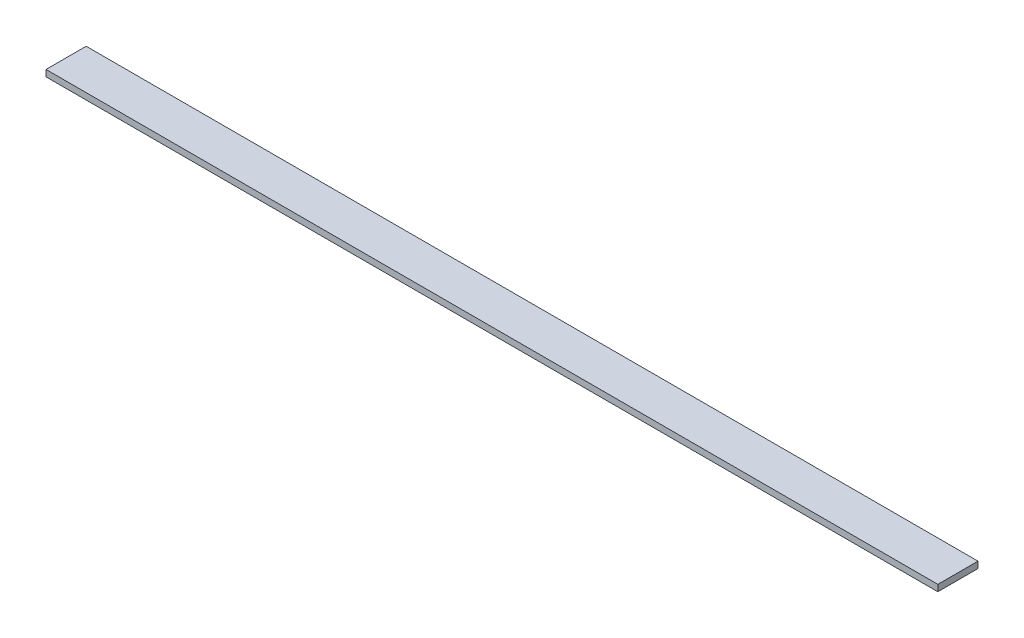
ISO-10303-21;
HEADER;
FILE_DESCRIPTION(('STEP AP214'),'2;1');
FILE_NAME('part.step','',(''),(''),'','','');
FILE_SCHEMA(('AUTOMOTIVE_DESIGN { 1 0 10303 214 1 1 1 1 }'));
ENDSEC;
DATA;
#1=APPLICATION_CONTEXT('core data for automotive mechanical design processes');
#2=APPLICATION_PROTOCOL_DEFINITION('international standard','automotive_design',2000,#1);
#3=PRODUCT_CONTEXT('',#1,'mechanical');
#4=PRODUCT('Part','Part','',(#3));
#5=PRODUCT_RELATED_PRODUCT_CATEGORY('part','',(#4));
#6=PRODUCT_DEFINITION_FORMATION('','',#4);
#7=PRODUCT_DEFINITION_CONTEXT('part definition',#1,'design');
#8=PRODUCT_DEFINITION('design','',#6,#7);
#9=PRODUCT_DEFINITION_SHAPE('','',#8);
#10=(LENGTH_UNIT() NAMED_UNIT(*) SI_UNIT(.MILLI.,.METRE.));
#11=(NAMED_UNIT(*) PLANE_ANGLE_UNIT() SI_UNIT($,.RADIAN.));
#12=(NAMED_UNIT(*) SI_UNIT($,.STERADIAN.) SOLID_ANGLE_UNIT());
#13=UNCERTAINTY_MEASURE_WITH_UNIT(LENGTH_MEASURE(1.E-05),#10,'distance_accuracy_value','');
#14=(GEOMETRIC_REPRESENTATION_CONTEXT(3) GLOBAL_UNCERTAINTY_ASSIGNED_CONTEXT((#13)) GLOBAL_UNIT_ASSIGNED_CONTEXT((#10,
#11,#12)) REPRESENTATION_CONTEXT('',''));
#15=CARTESIAN_POINT('',(0.,0.,0.));
#16=DIRECTION('',(0.,0.,1.));
#17=DIRECTION('',(1.,0.,0.));
#18=AXIS2_PLACEMENT_3D('',#15,#16,#17);
#19=CARTESIAN_POINT('',(277.5,4.,12.5));
#20=DIRECTION('',(-1.,0.,0.));
#21=DIRECTION('',(0.,0.,1.));
#22=AXIS2_PLACEMENT_3D('',#19,#20,#21);
#23=PLANE('',#22);
#24=DIRECTION('',(0.,0.,-1.));
#25=VECTOR('',#24,1.);
#26=CARTESIAN_POINT('',(277.5,0.,12.5));
#27=LINE('',#26,#25);
#28=CARTESIAN_POINT('',(277.5,0.,12.5));
#29=VERTEX_POINT('',#28);
#30=CARTESIAN_POINT('',(277.5,0.,-12.5));
#31=VERTEX_POINT('',#30);
#32=EDGE_CURVE('E98',#29,#31,#27,.T.);
#33=ORIENTED_EDGE('',*,*,#32,.T.);
#34=DIRECTION('',(0.,-1.,0.));
#35=VECTOR('',#34,1.);
#36=CARTESIAN_POINT('',(277.5,4.,-12.5));
#37=LINE('',#36,#35);
#38=CARTESIAN_POINT('',(277.5,4.,-12.5));
#39=VERTEX_POINT('',#38);
#40=EDGE_CURVE('E11',#39,#31,#37,.T.);
#41=ORIENTED_EDGE('',*,*,#40,.F.);
#42=DIRECTION('',(0.,0.,-1.));
#43=VECTOR('',#42,1.);
#44=CARTESIAN_POINT('',(277.5,4.,12.5));
#45=LINE('',#44,#43);
#46=CARTESIAN_POINT('',(277.5,4.,12.5));
#47=VERTEX_POINT('',#46);
#48=EDGE_CURVE('E86',#47,#39,#45,.T.);
#49=ORIENTED_EDGE('',*,*,#48,.F.);
#50=DIRECTION('',(0.,-1.,0.));
#51=VECTOR('',#50,1.);
#52=CARTESIAN_POINT('',(277.5,4.,12.5));
#53=LINE('',#52,#51);
#54=EDGE_CURVE('E94',#47,#29,#53,.T.);
#55=ORIENTED_EDGE('',*,*,#54,.T.);
#56=EDGE_LOOP('',(#33,#41,#49,#55));
#57=FACE_BOUND('',#56,.T.);
#58=ADVANCED_FACE('F35',(#57),#23,.F.);
#59=CARTESIAN_POINT('',(-277.5,4.,-12.5));
#60=DIRECTION('',(0.,0.,1.));
#61=DIRECTION('',(1.,0.,0.));
#62=AXIS2_PLACEMENT_3D('',#59,#60,#61);
#63=PLANE('',#62);
#64=DIRECTION('',(-1.,0.,0.));
#65=VECTOR('',#64,1.);
#66=CARTESIAN_POINT('',(-277.5,0.,-12.5));
#67=LINE('',#66,#65);
#68=CARTESIAN_POINT('',(-277.5,0.,-12.5));
#69=VERTEX_POINT('',#68);
#70=EDGE_CURVE('E90',#31,#69,#67,.T.);
#71=ORIENTED_EDGE('',*,*,#70,.T.);
#72=DIRECTION('',(0.,-1.,0.));
#73=VECTOR('',#72,1.);
#74=CARTESIAN_POINT('',(-277.5,4.,-12.5));
#75=LINE('',#74,#73);
#76=CARTESIAN_POINT('',(-277.5,4.,-12.5));
#77=VERTEX_POINT('',#76);
#78=EDGE_CURVE('E43',#77,#69,#75,.T.);
#79=ORIENTED_EDGE('',*,*,#78,.F.);
#80=DIRECTION('',(-1.,0.,0.));
#81=VECTOR('',#80,1.);
#82=CARTESIAN_POINT('',(-277.5,4.,-12.5));
#83=LINE('',#82,#81);
#84=EDGE_CURVE('E81',#39,#77,#83,.T.);
#85=ORIENTED_EDGE('',*,*,#84,.F.);
#86=ORIENTED_EDGE('',*,*,#40,.T.);
#87=EDGE_LOOP('',(#71,#79,#85,#86));
#88=FACE_BOUND('',#87,.T.);
#89=ADVANCED_FACE('F89',(#88),#63,.F.);
#90=CARTESIAN_POINT('',(-277.5,4.,12.5));
#91=DIRECTION('',(1.,0.,0.));
#92=DIRECTION('',(0.,0.,-1.));
#93=AXIS2_PLACEMENT_3D('',#90,#91,#92);
#94=PLANE('',#93);
#95=DIRECTION('',(0.,0.,1.));
#96=VECTOR('',#95,1.);
#97=CARTESIAN_POINT('',(-277.5,0.,12.5));
#98=LINE('',#97,#96);
#99=CARTESIAN_POINT('',(-277.5,0.,12.5));
#100=VERTEX_POINT('',#99);
#101=EDGE_CURVE('E68',#69,#100,#98,.T.);
#102=ORIENTED_EDGE('',*,*,#101,.T.);
#103=DIRECTION('',(0.,-1.,0.));
#104=VECTOR('',#103,1.);
#105=CARTESIAN_POINT('',(-277.5,4.,12.5));
#106=LINE('',#105,#104);
#107=CARTESIAN_POINT('',(-277.5,4.,12.5));
#108=VERTEX_POINT('',#107);
#109=EDGE_CURVE('E91',#108,#100,#106,.T.);
#110=ORIENTED_EDGE('',*,*,#109,.F.);
#111=DIRECTION('',(0.,0.,1.));
#112=VECTOR('',#111,1.);
#113=CARTESIAN_POINT('',(-277.5,4.,12.5));
#114=LINE('',#113,#112);
#115=EDGE_CURVE('E84',#77,#108,#114,.T.);
#116=ORIENTED_EDGE('',*,*,#115,.F.);
#117=ORIENTED_EDGE('',*,*,#78,.T.);
#118=EDGE_LOOP('',(#102,#110,#116,#117));
#119=FACE_BOUND('',#118,.T.);
#120=ADVANCED_FACE('F92',(#119),#94,.F.);
#121=CARTESIAN_POINT('',(-277.5,4.,12.5));
#122=DIRECTION('',(0.,0.,-1.));
#123=DIRECTION('',(-1.,0.,0.));
#124=AXIS2_PLACEMENT_3D('',#121,#122,#123);
#125=PLANE('',#124);
#126=DIRECTION('',(1.,0.,0.));
#127=VECTOR('',#126,1.);
#128=CARTESIAN_POINT('',(-277.5,0.,12.5));
#129=LINE('',#128,#127);
#130=EDGE_CURVE('E74',#100,#29,#129,.T.);
#131=ORIENTED_EDGE('',*,*,#130,.T.);
#132=ORIENTED_EDGE('',*,*,#54,.F.);
#133=DIRECTION('',(1.,0.,0.));
#134=VECTOR('',#133,1.);
#135=CARTESIAN_POINT('',(-277.5,4.,12.5));
#136=LINE('',#135,#134);
#137=EDGE_CURVE('E51',#108,#47,#136,.T.);
#138=ORIENTED_EDGE('',*,*,#137,.F.);
#139=ORIENTED_EDGE('',*,*,#109,.T.);
#140=EDGE_LOOP('',(#131,#132,#138,#139));
#141=FACE_BOUND('',#140,.T.);
#142=ADVANCED_FACE('F105',(#141),#125,.F.);
#143=CARTESIAN_POINT('',(0.,4.,0.));
#144=DIRECTION('',(0.,-1.,0.));
#145=DIRECTION('',(0.,0.,-1.));
#146=AXIS2_PLACEMENT_3D('',#143,#144,#145);
#147=PLANE('',#146);
#148=ORIENTED_EDGE('',*,*,#48,.T.);
#149=ORIENTED_EDGE('',*,*,#84,.T.);
#150=ORIENTED_EDGE('',*,*,#115,.T.);
#151=ORIENTED_EDGE('',*,*,#137,.T.);
#152=EDGE_LOOP('',(#148,#149,#150,#151));
#153=FACE_BOUND('',#152,.T.);
#154=ADVANCED_FACE('F82',(#153),#147,.F.);
#155=CARTESIAN_POINT('',(0.,0.,0.));
#156=DIRECTION('',(0.,-1.,0.));
#157=DIRECTION('',(0.,0.,-1.));
#158=AXIS2_PLACEMENT_3D('',#155,#156,#157);
#159=PLANE('',#158);
#160=ORIENTED_EDGE('',*,*,#32,.F.);
#161=ORIENTED_EDGE('',*,*,#130,.F.);
#162=ORIENTED_EDGE('',*,*,#101,.F.);
#163=ORIENTED_EDGE('',*,*,#70,.F.);
#164=EDGE_LOOP('',(#160,#161,#162,#163));
#165=FACE_BOUND('',#164,.T.);
#166=ADVANCED_FACE('F108',(#165),#159,.T.);
#167=CLOSED_SHELL('',(#58,#89,#120,#142,#154,#166));
#168=MANIFOLD_SOLID_BREP('B2',#167);
#169=ADVANCED_BREP_SHAPE_REPRESENTATION('',(#18,#168),#14);
#170=SHAPE_DEFINITION_REPRESENTATION(#9,#169);
ENDSEC;
END-ISO-10303-21;
